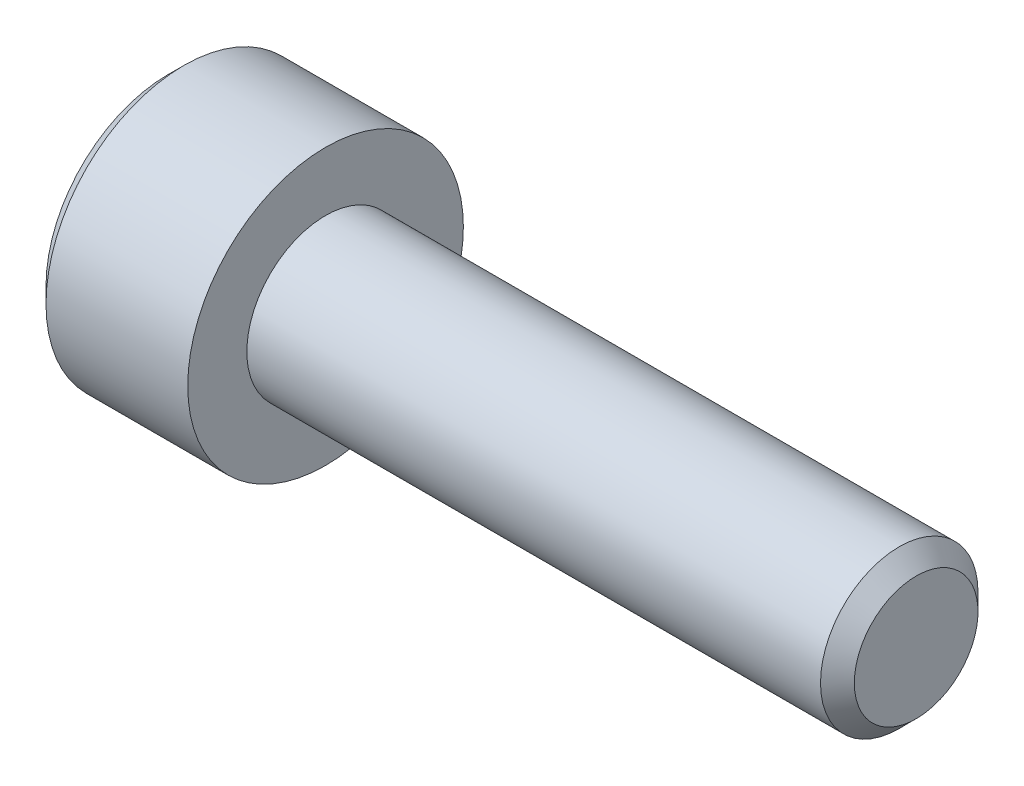
ISO-10303-21;
HEADER;
FILE_DESCRIPTION(('STEP AP214'),'2;1');
FILE_NAME('part.step','',(''),(''),'','','');
FILE_SCHEMA(('AUTOMOTIVE_DESIGN { 1 0 10303 214 1 1 1 1 }'));
ENDSEC;
DATA;
#1=APPLICATION_CONTEXT('core data for automotive mechanical design processes');
#2=APPLICATION_PROTOCOL_DEFINITION('international standard','automotive_design',2000,#1);
#3=PRODUCT_CONTEXT('',#1,'mechanical');
#4=PRODUCT('Part','Part','',(#3));
#5=PRODUCT_RELATED_PRODUCT_CATEGORY('part','',(#4));
#6=PRODUCT_DEFINITION_FORMATION('','',#4);
#7=PRODUCT_DEFINITION_CONTEXT('part definition',#1,'design');
#8=PRODUCT_DEFINITION('design','',#6,#7);
#9=PRODUCT_DEFINITION_SHAPE('','',#8);
#10=(LENGTH_UNIT() NAMED_UNIT(*) SI_UNIT(.MILLI.,.METRE.));
#11=(NAMED_UNIT(*) PLANE_ANGLE_UNIT() SI_UNIT($,.RADIAN.));
#12=(NAMED_UNIT(*) SI_UNIT($,.STERADIAN.) SOLID_ANGLE_UNIT());
#13=UNCERTAINTY_MEASURE_WITH_UNIT(LENGTH_MEASURE(1.E-05),#10,'distance_accuracy_value','');
#14=(GEOMETRIC_REPRESENTATION_CONTEXT(3) GLOBAL_UNCERTAINTY_ASSIGNED_CONTEXT((#13)) GLOBAL_UNIT_ASSIGNED_CONTEXT((#10,
#11,#12)) REPRESENTATION_CONTEXT('',''));
#15=CARTESIAN_POINT('',(0.,0.,0.));
#16=DIRECTION('',(0.,0.,1.));
#17=DIRECTION('',(1.,0.,0.));
#18=AXIS2_PLACEMENT_3D('',#15,#16,#17);
#19=CARTESIAN_POINT('',(-2.,0.,0.));
#20=DIRECTION('',(1.,0.,0.));
#21=DIRECTION('',(0.,0.,-1.));
#22=AXIS2_PLACEMENT_3D('',#19,#20,#21);
#23=PLANE('',#22);
#24=DIRECTION('',(0.,0.5,-0.866025403784439));
#25=VECTOR('',#24,1.);
#26=CARTESIAN_POINT('',(-2.,-0.866025403784439,-1.5));
#27=LINE('',#26,#25);
#28=CARTESIAN_POINT('',(-2.00000000036107,-1.29903810558746,-0.749999999948499));
#29=VERTEX_POINT('',#28);
#30=CARTESIAN_POINT('',(-2.,-1.73205080756888,0.));
#31=VERTEX_POINT('',#30);
#32=EDGE_CURVE('E139',#29,#31,#27,.F.);
#33=ORIENTED_EDGE('',*,*,#32,.T.);
#34=DIRECTION('',(0.,-0.5,-0.866025403784439));
#35=VECTOR('',#34,1.);
#36=CARTESIAN_POINT('',(-2.,-1.73205080756888,0.));
#37=LINE('',#36,#35);
#38=CARTESIAN_POINT('',(-2.00000000036107,-1.29903810558746,0.7499999999485));
#39=VERTEX_POINT('',#38);
#40=EDGE_CURVE('E142',#31,#39,#37,.F.);
#41=ORIENTED_EDGE('',*,*,#40,.T.);
#42=CARTESIAN_POINT('',(-2.00000000072213,0.,0.));
#43=DIRECTION('',(-1.,0.,0.));
#44=DIRECTION('',(0.,0.,1.));
#45=AXIS2_PLACEMENT_3D('',#42,#43,#44);
#46=CIRCLE('',#45,1.499999999794);
#47=EDGE_CURVE('E118',#39,#29,#46,.F.);
#48=ORIENTED_EDGE('',*,*,#47,.T.);
#49=EDGE_LOOP('',(#33,#41,#48));
#50=FACE_BOUND('',#49,.T.);
#51=ADVANCED_FACE('F18',(#50),#23,.F.);
#52=CARTESIAN_POINT('',(-2.,0.,0.));
#53=DIRECTION('',(1.,0.,0.));
#54=DIRECTION('',(0.,0.,-1.));
#55=AXIS2_PLACEMENT_3D('',#52,#53,#54);
#56=PLANE('',#55);
#57=DIRECTION('',(0.,1.,0.));
#58=VECTOR('',#57,1.);
#59=CARTESIAN_POINT('',(-2.,0.866025403784439,-1.5));
#60=LINE('',#59,#58);
#61=CARTESIAN_POINT('',(-2.00000000036107,0.,-1.499999999897));
#62=VERTEX_POINT('',#61);
#63=CARTESIAN_POINT('',(-2.,-0.866025403784439,-1.5));
#64=VERTEX_POINT('',#63);
#65=EDGE_CURVE('E208',#62,#64,#60,.F.);
#66=ORIENTED_EDGE('',*,*,#65,.T.);
#67=DIRECTION('',(0.,0.5,-0.866025403784439));
#68=VECTOR('',#67,1.);
#69=CARTESIAN_POINT('',(-2.,-0.866025403784439,-1.5));
#70=LINE('',#69,#68);
#71=EDGE_CURVE('E147',#64,#29,#70,.F.);
#72=ORIENTED_EDGE('',*,*,#71,.T.);
#73=CARTESIAN_POINT('',(-2.00000000072213,0.,0.));
#74=DIRECTION('',(-1.,0.,0.));
#75=DIRECTION('',(0.,0.,1.));
#76=AXIS2_PLACEMENT_3D('',#73,#74,#75);
#77=CIRCLE('',#76,1.499999999794);
#78=EDGE_CURVE('E132',#29,#62,#77,.F.);
#79=ORIENTED_EDGE('',*,*,#78,.T.);
#80=EDGE_LOOP('',(#66,#72,#79));
#81=FACE_BOUND('',#80,.T.);
#82=ADVANCED_FACE('F287',(#81),#56,.F.);
#83=CARTESIAN_POINT('',(-4.,-0.866025403784439,-1.5));
#84=DIRECTION('',(0.,-0.866025403784439,-0.5));
#85=DIRECTION('',(0.,0.5,-0.866025403784439));
#86=AXIS2_PLACEMENT_3D('',#83,#84,#85);
#87=PLANE('',#86);
#88=DIRECTION('',(1.,0.,0.));
#89=VECTOR('',#88,1.);
#90=CARTESIAN_POINT('',(-4.,-1.73205080756888,0.));
#91=LINE('',#90,#89);
#92=CARTESIAN_POINT('',(-4.,-1.73205080756888,0.));
#93=VERTEX_POINT('',#92);
#94=EDGE_CURVE('E150',#93,#31,#91,.T.);
#95=ORIENTED_EDGE('',*,*,#94,.T.);
#96=ORIENTED_EDGE('',*,*,#32,.F.);
#97=ORIENTED_EDGE('',*,*,#71,.F.);
#98=DIRECTION('',(-1.,0.,0.));
#99=VECTOR('',#98,1.);
#100=CARTESIAN_POINT('',(-4.,-0.866025403784439,-1.5));
#101=LINE('',#100,#99);
#102=CARTESIAN_POINT('',(-4.,-0.866025403784439,-1.5));
#103=VERTEX_POINT('',#102);
#104=EDGE_CURVE('E163',#64,#103,#101,.T.);
#105=ORIENTED_EDGE('',*,*,#104,.T.);
#106=DIRECTION('',(0.,0.5,-0.866025403784439));
#107=VECTOR('',#106,1.);
#108=CARTESIAN_POINT('',(-4.,-0.866025403784439,-1.5));
#109=LINE('',#108,#107);
#110=EDGE_CURVE('E151',#93,#103,#109,.T.);
#111=ORIENTED_EDGE('',*,*,#110,.F.);
#112=EDGE_LOOP('',(#95,#96,#97,#105,#111));
#113=FACE_BOUND('',#112,.T.);
#114=ADVANCED_FACE('F145',(#113),#87,.F.);
#115=CARTESIAN_POINT('',(-4.,-1.73205080756888,0.));
#116=DIRECTION('',(0.,-0.866025403784439,0.5));
#117=DIRECTION('',(0.,-0.5,-0.866025403784439));
#118=AXIS2_PLACEMENT_3D('',#115,#116,#117);
#119=PLANE('',#118);
#120=DIRECTION('',(1.,0.,0.));
#121=VECTOR('',#120,1.);
#122=CARTESIAN_POINT('',(-4.,-0.866025403784439,1.5));
#123=LINE('',#122,#121);
#124=CARTESIAN_POINT('',(-4.,-0.86602540378444,1.5));
#125=VERTEX_POINT('',#124);
#126=CARTESIAN_POINT('',(-2.,-0.866025403784439,1.5));
#127=VERTEX_POINT('',#126);
#128=EDGE_CURVE('E100',#125,#127,#123,.T.);
#129=ORIENTED_EDGE('',*,*,#128,.T.);
#130=DIRECTION('',(0.,-0.500000000000001,-0.866025403784438));
#131=VECTOR('',#130,1.);
#132=CARTESIAN_POINT('',(-2.,-0.866025403784439,1.5));
#133=LINE('',#132,#131);
#134=EDGE_CURVE('E96',#127,#39,#133,.T.);
#135=ORIENTED_EDGE('',*,*,#134,.T.);
#136=ORIENTED_EDGE('',*,*,#40,.F.);
#137=ORIENTED_EDGE('',*,*,#94,.F.);
#138=DIRECTION('',(0.,-0.5,-0.866025403784439));
#139=VECTOR('',#138,1.);
#140=CARTESIAN_POINT('',(-4.,-1.73205080756888,0.));
#141=LINE('',#140,#139);
#142=EDGE_CURVE('E221',#125,#93,#141,.T.);
#143=ORIENTED_EDGE('',*,*,#142,.F.);
#144=EDGE_LOOP('',(#129,#135,#136,#137,#143));
#145=FACE_BOUND('',#144,.T.);
#146=ADVANCED_FACE('F250',(#145),#119,.F.);
#147=CARTESIAN_POINT('',(-2.,0.,0.));
#148=DIRECTION('',(1.,0.,0.));
#149=DIRECTION('',(0.,0.,-1.));
#150=AXIS2_PLACEMENT_3D('',#147,#148,#149);
#151=PLANE('',#150);
#152=ORIENTED_EDGE('',*,*,#134,.F.);
#153=DIRECTION('',(0.,1.,0.));
#154=VECTOR('',#153,1.);
#155=CARTESIAN_POINT('',(-2.,-0.866025403784439,1.5));
#156=LINE('',#155,#154);
#157=CARTESIAN_POINT('',(-2.00000000036107,0.,1.499999999897));
#158=VERTEX_POINT('',#157);
#159=EDGE_CURVE('E90',#127,#158,#156,.T.);
#160=ORIENTED_EDGE('',*,*,#159,.T.);
#161=CARTESIAN_POINT('',(-2.00000000072213,0.,0.));
#162=DIRECTION('',(-1.,0.,0.));
#163=DIRECTION('',(0.,0.,1.));
#164=AXIS2_PLACEMENT_3D('',#161,#162,#163);
#165=CIRCLE('',#164,1.499999999794);
#166=EDGE_CURVE('E21',#158,#39,#165,.F.);
#167=ORIENTED_EDGE('',*,*,#166,.T.);
#168=EDGE_LOOP('',(#152,#160,#167));
#169=FACE_BOUND('',#168,.T.);
#170=ADVANCED_FACE('F92',(#169),#151,.F.);
#171=CARTESIAN_POINT('',(-2.00000000069167,0.,0.));
#172=DIRECTION('',(-1.,0.,0.));
#173=DIRECTION('',(0.,0.,1.));
#174=AXIS2_PLACEMENT_3D('',#171,#172,#173);
#175=CONICAL_SURFACE('',#174,1.49999999968031,1.30899693744846);
#176=CARTESIAN_POINT('',(-1.59807620971719,-5.6843418860808E-11,0.));
#177=VERTEX_POINT('',#176);
#178=VERTEX_LOOP('',#177);
#179=FACE_BOUND('',#178,.T.);
#180=CARTESIAN_POINT('',(-2.00000000072213,0.,0.));
#181=DIRECTION('',(-1.,0.,0.));
#182=DIRECTION('',(0.,0.,1.));
#183=AXIS2_PLACEMENT_3D('',#180,#181,#182);
#184=CIRCLE('',#183,1.499999999794);
#185=CARTESIAN_POINT('',(-2.00000000036107,1.29903810558746,-0.7499999999485));
#186=VERTEX_POINT('',#185);
#187=EDGE_CURVE('E128',#186,#62,#184,.T.);
#188=ORIENTED_EDGE('',*,*,#187,.T.);
#189=ORIENTED_EDGE('',*,*,#78,.F.);
#190=ORIENTED_EDGE('',*,*,#47,.F.);
#191=ORIENTED_EDGE('',*,*,#166,.F.);
#192=CARTESIAN_POINT('',(-2.00000000072213,0.,0.));
#193=DIRECTION('',(-1.,0.,0.));
#194=DIRECTION('',(0.,0.,1.));
#195=AXIS2_PLACEMENT_3D('',#192,#193,#194);
#196=CIRCLE('',#195,1.499999999794);
#197=CARTESIAN_POINT('',(-2.00000000036107,1.29903810558746,0.749999999948499));
#198=VERTEX_POINT('',#197);
#199=EDGE_CURVE('E111',#158,#198,#196,.T.);
#200=ORIENTED_EDGE('',*,*,#199,.T.);
#201=CARTESIAN_POINT('',(-2.00000000072213,0.,0.));
#202=DIRECTION('',(-1.,0.,0.));
#203=DIRECTION('',(0.,0.,1.));
#204=AXIS2_PLACEMENT_3D('',#201,#202,#203);
#205=CIRCLE('',#204,1.499999999794);
#206=EDGE_CURVE('E122',#198,#186,#205,.T.);
#207=ORIENTED_EDGE('',*,*,#206,.T.);
#208=EDGE_LOOP('',(#188,#189,#190,#191,#200,#207));
#209=FACE_BOUND('',#208,.T.);
#210=ADVANCED_FACE('F115',(#179,#209),#175,.F.);
#211=CARTESIAN_POINT('',(-2.,0.,0.));
#212=DIRECTION('',(1.,0.,0.));
#213=DIRECTION('',(0.,0.,-1.));
#214=AXIS2_PLACEMENT_3D('',#211,#212,#213);
#215=PLANE('',#214);
#216=DIRECTION('',(0.,0.5,0.866025403784439));
#217=VECTOR('',#216,1.);
#218=CARTESIAN_POINT('',(-2.,1.73205080756888,0.));
#219=LINE('',#218,#217);
#220=CARTESIAN_POINT('',(-2.,0.866025403784441,-1.5));
#221=VERTEX_POINT('',#220);
#222=EDGE_CURVE('E201',#186,#221,#219,.F.);
#223=ORIENTED_EDGE('',*,*,#222,.T.);
#224=DIRECTION('',(0.,1.,0.));
#225=VECTOR('',#224,1.);
#226=CARTESIAN_POINT('',(-2.,0.866025403784439,-1.5));
#227=LINE('',#226,#225);
#228=EDGE_CURVE('E131',#221,#62,#227,.F.);
#229=ORIENTED_EDGE('',*,*,#228,.T.);
#230=ORIENTED_EDGE('',*,*,#187,.F.);
#231=EDGE_LOOP('',(#223,#229,#230));
#232=FACE_BOUND('',#231,.T.);
#233=ADVANCED_FACE('F285',(#232),#215,.F.);
#234=CARTESIAN_POINT('',(-4.,0.866025403784439,-1.5));
#235=DIRECTION('',(0.,0.,-1.));
#236=DIRECTION('',(-1.,0.,0.));
#237=AXIS2_PLACEMENT_3D('',#234,#235,#236);
#238=PLANE('',#237);
#239=ORIENTED_EDGE('',*,*,#104,.F.);
#240=ORIENTED_EDGE('',*,*,#65,.F.);
#241=ORIENTED_EDGE('',*,*,#228,.F.);
#242=DIRECTION('',(1.,0.,0.));
#243=VECTOR('',#242,1.);
#244=CARTESIAN_POINT('',(-4.,0.866025403784441,-1.5));
#245=LINE('',#244,#243);
#246=CARTESIAN_POINT('',(-4.,0.86602540378444,-1.5));
#247=VERTEX_POINT('',#246);
#248=EDGE_CURVE('E203',#221,#247,#245,.F.);
#249=ORIENTED_EDGE('',*,*,#248,.T.);
#250=DIRECTION('',(0.,1.,0.));
#251=VECTOR('',#250,1.);
#252=CARTESIAN_POINT('',(-4.,0.866025403784439,-1.5));
#253=LINE('',#252,#251);
#254=EDGE_CURVE('E161',#103,#247,#253,.T.);
#255=ORIENTED_EDGE('',*,*,#254,.F.);
#256=EDGE_LOOP('',(#239,#240,#241,#249,#255));
#257=FACE_BOUND('',#256,.T.);
#258=ADVANCED_FACE('F244',(#257),#238,.F.);
#259=CARTESIAN_POINT('',(-4.,-0.866025403784439,1.5));
#260=DIRECTION('',(0.,0.,1.));
#261=DIRECTION('',(1.,0.,0.));
#262=AXIS2_PLACEMENT_3D('',#259,#260,#261);
#263=PLANE('',#262);
#264=DIRECTION('',(1.,0.,0.));
#265=VECTOR('',#264,1.);
#266=CARTESIAN_POINT('',(-4.,0.866025403784439,1.5));
#267=LINE('',#266,#265);
#268=CARTESIAN_POINT('',(-4.,0.866025403784439,1.5));
#269=VERTEX_POINT('',#268);
#270=CARTESIAN_POINT('',(-2.,0.866025403784439,1.5));
#271=VERTEX_POINT('',#270);
#272=EDGE_CURVE('E106',#269,#271,#267,.T.);
#273=ORIENTED_EDGE('',*,*,#272,.T.);
#274=DIRECTION('',(0.,1.,0.));
#275=VECTOR('',#274,1.);
#276=CARTESIAN_POINT('',(-2.,0.,1.5));
#277=LINE('',#276,#275);
#278=EDGE_CURVE('E103',#271,#158,#277,.F.);
#279=ORIENTED_EDGE('',*,*,#278,.T.);
#280=ORIENTED_EDGE('',*,*,#159,.F.);
#281=ORIENTED_EDGE('',*,*,#128,.F.);
#282=DIRECTION('',(0.,1.,0.));
#283=VECTOR('',#282,1.);
#284=CARTESIAN_POINT('',(-4.,-0.866025403784439,1.5));
#285=LINE('',#284,#283);
#286=EDGE_CURVE('E99',#269,#125,#285,.F.);
#287=ORIENTED_EDGE('',*,*,#286,.F.);
#288=EDGE_LOOP('',(#273,#279,#280,#281,#287));
#289=FACE_BOUND('',#288,.T.);
#290=ADVANCED_FACE('F104',(#289),#263,.F.);
#291=CARTESIAN_POINT('',(-2.,0.,0.));
#292=DIRECTION('',(1.,0.,0.));
#293=DIRECTION('',(0.,0.,-1.));
#294=AXIS2_PLACEMENT_3D('',#291,#292,#293);
#295=PLANE('',#294);
#296=ORIENTED_EDGE('',*,*,#278,.F.);
#297=DIRECTION('',(0.,-0.5,0.866025403784439));
#298=VECTOR('',#297,1.);
#299=CARTESIAN_POINT('',(-2.,0.866025403784439,1.5));
#300=LINE('',#299,#298);
#301=EDGE_CURVE('E120',#271,#198,#300,.F.);
#302=ORIENTED_EDGE('',*,*,#301,.T.);
#303=ORIENTED_EDGE('',*,*,#199,.F.);
#304=EDGE_LOOP('',(#296,#302,#303));
#305=FACE_BOUND('',#304,.T.);
#306=ADVANCED_FACE('F119',(#305),#295,.F.);
#307=CARTESIAN_POINT('',(-2.,0.,0.));
#308=DIRECTION('',(1.,0.,0.));
#309=DIRECTION('',(0.,0.,-1.));
#310=AXIS2_PLACEMENT_3D('',#307,#308,#309);
#311=PLANE('',#310);
#312=DIRECTION('',(0.,-0.5,0.866025403784439));
#313=VECTOR('',#312,1.);
#314=CARTESIAN_POINT('',(-2.,0.866025403784439,1.5));
#315=LINE('',#314,#313);
#316=CARTESIAN_POINT('',(-2.,1.73205080756888,0.));
#317=VERTEX_POINT('',#316);
#318=EDGE_CURVE('E193',#198,#317,#315,.F.);
#319=ORIENTED_EDGE('',*,*,#318,.T.);
#320=DIRECTION('',(0.,0.5,0.866025403784439));
#321=VECTOR('',#320,1.);
#322=CARTESIAN_POINT('',(-2.,1.73205080756888,0.));
#323=LINE('',#322,#321);
#324=EDGE_CURVE('E124',#317,#186,#323,.F.);
#325=ORIENTED_EDGE('',*,*,#324,.T.);
#326=ORIENTED_EDGE('',*,*,#206,.F.);
#327=EDGE_LOOP('',(#319,#325,#326));
#328=FACE_BOUND('',#327,.T.);
#329=ADVANCED_FACE('F279',(#328),#311,.F.);
#330=CARTESIAN_POINT('',(-4.,1.73205080756888,0.));
#331=DIRECTION('',(0.,0.866025403784439,-0.5));
#332=DIRECTION('',(0.,0.5,0.866025403784439));
#333=AXIS2_PLACEMENT_3D('',#330,#331,#332);
#334=PLANE('',#333);
#335=ORIENTED_EDGE('',*,*,#248,.F.);
#336=ORIENTED_EDGE('',*,*,#222,.F.);
#337=ORIENTED_EDGE('',*,*,#324,.F.);
#338=DIRECTION('',(1.,0.,0.));
#339=VECTOR('',#338,1.);
#340=CARTESIAN_POINT('',(-4.,1.73205080756888,0.));
#341=LINE('',#340,#339);
#342=CARTESIAN_POINT('',(-4.,1.73205080756888,0.));
#343=VERTEX_POINT('',#342);
#344=EDGE_CURVE('E187',#317,#343,#341,.F.);
#345=ORIENTED_EDGE('',*,*,#344,.T.);
#346=DIRECTION('',(0.,0.5,0.866025403784439));
#347=VECTOR('',#346,1.);
#348=CARTESIAN_POINT('',(-4.,1.73205080756888,0.));
#349=LINE('',#348,#347);
#350=EDGE_CURVE('E36',#247,#343,#349,.T.);
#351=ORIENTED_EDGE('',*,*,#350,.F.);
#352=EDGE_LOOP('',(#335,#336,#337,#345,#351));
#353=FACE_BOUND('',#352,.T.);
#354=ADVANCED_FACE('F283',(#353),#334,.F.);
#355=CARTESIAN_POINT('',(-4.,0.866025403784439,1.5));
#356=DIRECTION('',(0.,0.866025403784439,0.5));
#357=DIRECTION('',(0.,-0.5,0.866025403784439));
#358=AXIS2_PLACEMENT_3D('',#355,#356,#357);
#359=PLANE('',#358);
#360=ORIENTED_EDGE('',*,*,#344,.F.);
#361=ORIENTED_EDGE('',*,*,#318,.F.);
#362=ORIENTED_EDGE('',*,*,#301,.F.);
#363=ORIENTED_EDGE('',*,*,#272,.F.);
#364=DIRECTION('',(0.,-0.500000000000001,0.866025403784438));
#365=VECTOR('',#364,1.);
#366=CARTESIAN_POINT('',(-4.,1.73205080756888,0.));
#367=LINE('',#366,#365);
#368=EDGE_CURVE('E178',#343,#269,#367,.T.);
#369=ORIENTED_EDGE('',*,*,#368,.F.);
#370=EDGE_LOOP('',(#360,#361,#362,#363,#369));
#371=FACE_BOUND('',#370,.T.);
#372=ADVANCED_FACE('F253',(#371),#359,.F.);
#373=CARTESIAN_POINT('',(-4.,1.55,0.));
#374=DIRECTION('',(-1.,0.,0.));
#375=DIRECTION('',(0.,0.,1.));
#376=AXIS2_PLACEMENT_3D('',#373,#374,#375);
#377=PLANE('',#376);
#378=ORIENTED_EDGE('',*,*,#350,.T.);
#379=ORIENTED_EDGE('',*,*,#368,.T.);
#380=ORIENTED_EDGE('',*,*,#286,.T.);
#381=ORIENTED_EDGE('',*,*,#142,.T.);
#382=ORIENTED_EDGE('',*,*,#110,.T.);
#383=ORIENTED_EDGE('',*,*,#254,.T.);
#384=EDGE_LOOP('',(#378,#379,#380,#381,#382,#383));
#385=FACE_BOUND('',#384,.T.);
#386=CARTESIAN_POINT('',(-4.00000000024647,0.,0.));
#387=DIRECTION('',(1.,0.,0.));
#388=DIRECTION('',(0.,0.,-1.));
#389=AXIS2_PLACEMENT_3D('',#386,#387,#388);
#390=CIRCLE('',#389,3.10000000024502);
#391=CARTESIAN_POINT('',(-4.00000000024647,0.,-3.10000000024502));
#392=VERTEX_POINT('',#391);
#393=EDGE_CURVE('E175',#392,#392,#390,.T.);
#394=ORIENTED_EDGE('',*,*,#393,.F.);
#395=EDGE_LOOP('',(#394));
#396=FACE_BOUND('',#395,.T.);
#397=ADVANCED_FACE('F247',(#385,#396),#377,.T.);
#398=CARTESIAN_POINT('',(-3.59999999977845,0.,0.));
#399=DIRECTION('',(1.,0.,0.));
#400=DIRECTION('',(0.,0.,-1.));
#401=AXIS2_PLACEMENT_3D('',#398,#399,#400);
#402=CONICAL_SURFACE('',#401,3.49999999991724,0.785398162402689);
#403=CARTESIAN_POINT('',(-3.6,0.,0.));
#404=DIRECTION('',(1.,0.,0.));
#405=DIRECTION('',(0.,0.,-1.));
#406=AXIS2_PLACEMENT_3D('',#403,#404,#405);
#407=CIRCLE('',#406,3.5);
#408=CARTESIAN_POINT('',(-3.6,0.,-3.5));
#409=VERTEX_POINT('',#408);
#410=EDGE_CURVE('E174',#409,#409,#407,.T.);
#411=ORIENTED_EDGE('',*,*,#410,.F.);
#412=EDGE_LOOP('',(#411));
#413=FACE_BOUND('',#412,.T.);
#414=ORIENTED_EDGE('',*,*,#393,.T.);
#415=EDGE_LOOP('',(#414));
#416=FACE_BOUND('',#415,.T.);
#417=ADVANCED_FACE('F317',(#413,#416),#402,.T.);
#418=CARTESIAN_POINT('',(-1.8,0.,0.));
#419=DIRECTION('',(1.,0.,0.));
#420=DIRECTION('',(0.,0.,-1.));
#421=AXIS2_PLACEMENT_3D('',#418,#419,#420);
#422=CYLINDRICAL_SURFACE('',#421,3.5);
#423=CARTESIAN_POINT('',(0.,0.,0.));
#424=DIRECTION('',(1.,0.,0.));
#425=DIRECTION('',(0.,0.,-1.));
#426=AXIS2_PLACEMENT_3D('',#423,#424,#425);
#427=CIRCLE('',#426,3.5);
#428=CARTESIAN_POINT('',(0.,0.,-3.5));
#429=VERTEX_POINT('',#428);
#430=EDGE_CURVE('E172',#429,#429,#427,.T.);
#431=ORIENTED_EDGE('',*,*,#430,.F.);
#432=EDGE_LOOP('',(#431));
#433=FACE_BOUND('',#432,.T.);
#434=ORIENTED_EDGE('',*,*,#410,.T.);
#435=EDGE_LOOP('',(#434));
#436=FACE_BOUND('',#435,.T.);
#437=ADVANCED_FACE('F313',(#433,#436),#422,.T.);
#438=CARTESIAN_POINT('',(15.,0.78525,0.));
#439=DIRECTION('',(1.,0.,0.));
#440=DIRECTION('',(0.,0.,-1.));
#441=AXIS2_PLACEMENT_3D('',#438,#439,#440);
#442=PLANE('',#441);
#443=CARTESIAN_POINT('',(15.0000000002137,0.,0.));
#444=DIRECTION('',(-1.,0.,0.));
#445=DIRECTION('',(0.,0.,1.));
#446=AXIS2_PLACEMENT_3D('',#443,#444,#445);
#447=CIRCLE('',#446,1.57050000024128);
#448=CARTESIAN_POINT('',(15.0000000002137,0.,1.57050000024128));
#449=VERTEX_POINT('',#448);
#450=EDGE_CURVE('E169',#449,#449,#447,.T.);
#451=ORIENTED_EDGE('',*,*,#450,.F.);
#452=EDGE_LOOP('',(#451));
#453=FACE_BOUND('',#452,.T.);
#454=ADVANCED_FACE('F309',(#453),#442,.T.);
#455=CARTESIAN_POINT('',(0.,2.75,0.));
#456=DIRECTION('',(1.,0.,0.));
#457=DIRECTION('',(0.,0.,-1.));
#458=AXIS2_PLACEMENT_3D('',#455,#456,#457);
#459=PLANE('',#458);
#460=CARTESIAN_POINT('',(0.,0.,0.));
#461=DIRECTION('',(1.,0.,0.));
#462=DIRECTION('',(0.,0.,-1.));
#463=AXIS2_PLACEMENT_3D('',#460,#461,#462);
#464=CIRCLE('',#463,2.);
#465=CARTESIAN_POINT('',(0.,0.,-2.));
#466=VERTEX_POINT('',#465);
#467=EDGE_CURVE('E27',#466,#466,#464,.T.);
#468=ORIENTED_EDGE('',*,*,#467,.F.);
#469=EDGE_LOOP('',(#468));
#470=FACE_BOUND('',#469,.T.);
#471=ORIENTED_EDGE('',*,*,#430,.T.);
#472=EDGE_LOOP('',(#471));
#473=FACE_BOUND('',#472,.T.);
#474=ADVANCED_FACE('F302',(#470,#473),#459,.T.);
#475=CARTESIAN_POINT('',(14.570499999877,0.,0.));
#476=DIRECTION('',(-1.,0.,0.));
#477=DIRECTION('',(0.,0.,1.));
#478=AXIS2_PLACEMENT_3D('',#475,#476,#477);
#479=CONICAL_SURFACE('',#478,1.99999999978218,0.785398162471013);
#480=ORIENTED_EDGE('',*,*,#450,.T.);
#481=EDGE_LOOP('',(#480));
#482=FACE_BOUND('',#481,.T.);
#483=CARTESIAN_POINT('',(14.5705,0.,0.));
#484=DIRECTION('',(1.,0.,0.));
#485=DIRECTION('',(0.,0.,-1.));
#486=AXIS2_PLACEMENT_3D('',#483,#484,#485);
#487=CIRCLE('',#486,2.);
#488=CARTESIAN_POINT('',(14.5705,0.,-2.));
#489=VERTEX_POINT('',#488);
#490=EDGE_CURVE('E11',#489,#489,#487,.F.);
#491=ORIENTED_EDGE('',*,*,#490,.F.);
#492=EDGE_LOOP('',(#491));
#493=FACE_BOUND('',#492,.T.);
#494=ADVANCED_FACE('F297',(#482,#493),#479,.T.);
#495=CARTESIAN_POINT('',(7.28525,0.,0.));
#496=DIRECTION('',(1.,0.,0.));
#497=DIRECTION('',(0.,0.,-1.));
#498=AXIS2_PLACEMENT_3D('',#495,#496,#497);
#499=CYLINDRICAL_SURFACE('',#498,2.);
#500=ORIENTED_EDGE('',*,*,#490,.T.);
#501=EDGE_LOOP('',(#500));
#502=FACE_BOUND('',#501,.T.);
#503=ORIENTED_EDGE('',*,*,#467,.T.);
#504=EDGE_LOOP('',(#503));
#505=FACE_BOUND('',#504,.T.);
#506=ADVANCED_FACE('F295',(#502,#505),#499,.T.);
#507=CLOSED_SHELL('',(#51,#82,#114,#146,#170,#210,#233,#258,#290,#306,#329,#354,#372,#397,#417,
#437,#454,#474,#494,#506));
#508=MANIFOLD_SOLID_BREP('B1',#507);
#509=ADVANCED_BREP_SHAPE_REPRESENTATION('',(#18,#508),#14);
#510=SHAPE_DEFINITION_REPRESENTATION(#9,#509);
ENDSEC;
END-ISO-10303-21;
